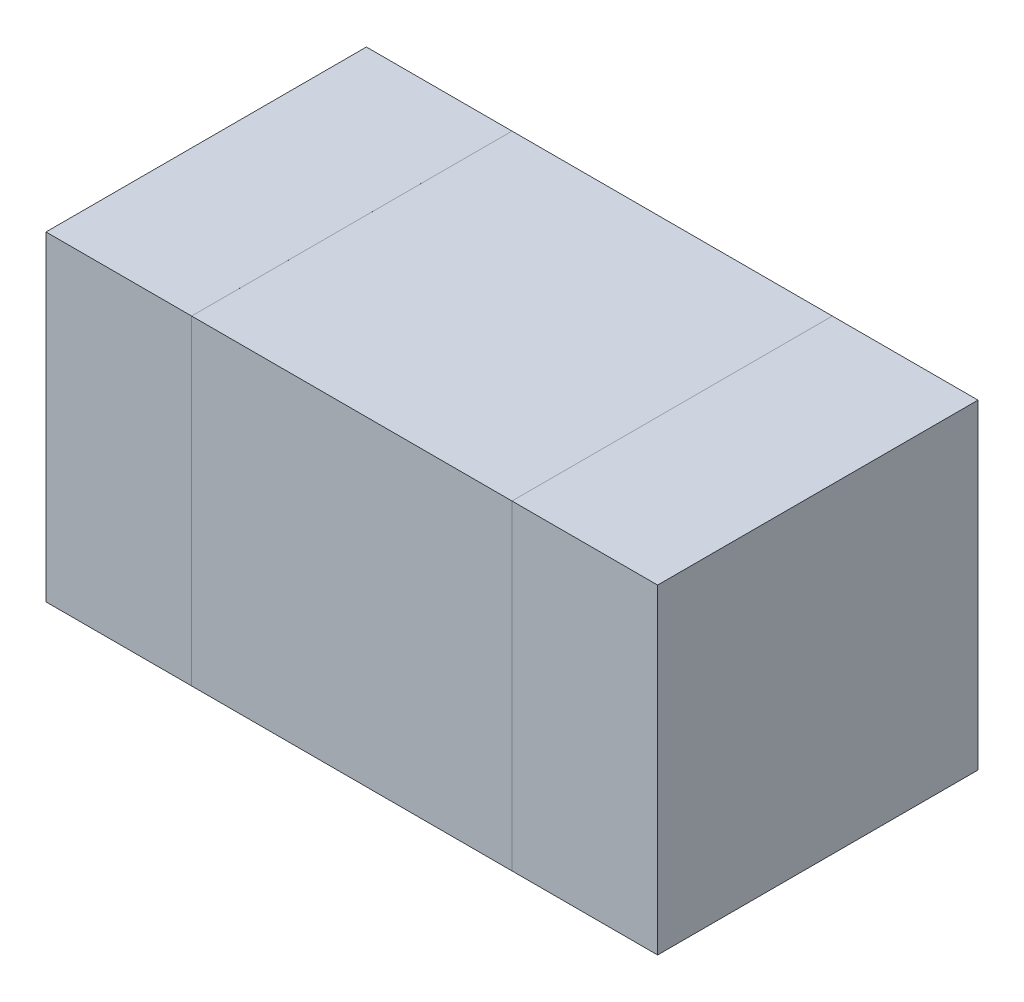
ISO-10303-21;
HEADER;
FILE_DESCRIPTION(('STEP AP214'),'2;1');
FILE_NAME('part.step','',(''),(''),'','','');
FILE_SCHEMA(('AUTOMOTIVE_DESIGN { 1 0 10303 214 1 1 1 1 }'));
ENDSEC;
DATA;
#1=APPLICATION_CONTEXT('core data for automotive mechanical design processes');
#2=APPLICATION_PROTOCOL_DEFINITION('international standard','automotive_design',2000,#1);
#3=PRODUCT_CONTEXT('',#1,'mechanical');
#4=PRODUCT('Part','Part','',(#3));
#5=PRODUCT_RELATED_PRODUCT_CATEGORY('part','',(#4));
#6=PRODUCT_DEFINITION_FORMATION('','',#4);
#7=PRODUCT_DEFINITION_CONTEXT('part definition',#1,'design');
#8=PRODUCT_DEFINITION('design','',#6,#7);
#9=PRODUCT_DEFINITION_SHAPE('','',#8);
#10=(LENGTH_UNIT() NAMED_UNIT(*) SI_UNIT(.MILLI.,.METRE.));
#11=(NAMED_UNIT(*) PLANE_ANGLE_UNIT() SI_UNIT($,.RADIAN.));
#12=(NAMED_UNIT(*) SI_UNIT($,.STERADIAN.) SOLID_ANGLE_UNIT());
#13=UNCERTAINTY_MEASURE_WITH_UNIT(LENGTH_MEASURE(1.E-05),#10,'distance_accuracy_value','');
#14=(GEOMETRIC_REPRESENTATION_CONTEXT(3) GLOBAL_UNCERTAINTY_ASSIGNED_CONTEXT((#13)) GLOBAL_UNIT_ASSIGNED_CONTEXT((#10,
#11,#12)) REPRESENTATION_CONTEXT('',''));
#15=CARTESIAN_POINT('',(0.,0.,0.));
#16=DIRECTION('',(0.,0.,1.));
#17=DIRECTION('',(1.,0.,0.));
#18=AXIS2_PLACEMENT_3D('',#15,#16,#17);
#19=CARTESIAN_POINT('',(1.489995475586,8.035000471953,0.32999934));
#20=DIRECTION('',(0.,0.,-1.));
#21=DIRECTION('',(0.,-1.,0.));
#22=AXIS2_PLACEMENT_3D('',#19,#20,#21);
#23=PLANE('',#22);
#24=DIRECTION('',(0.,1.,0.));
#25=VECTOR('',#24,1.);
#26=CARTESIAN_POINT('',(1.489995475586,8.035000471953,0.32999934));
#27=LINE('',#26,#25);
#28=CARTESIAN_POINT('',(1.489995475586,8.035000471953,0.32999934));
#29=VERTEX_POINT('',#28);
#30=CARTESIAN_POINT('',(1.489995475586,8.365002351953,0.32999934));
#31=VERTEX_POINT('',#30);
#32=EDGE_CURVE('P0_E79',#29,#31,#27,.T.);
#33=ORIENTED_EDGE('',*,*,#32,.T.);
#34=DIRECTION('',(-1.,0.,0.));
#35=VECTOR('',#34,1.);
#36=CARTESIAN_POINT('',(1.489995475586,8.365002351953,0.32999934));
#37=LINE('',#36,#35);
#38=CARTESIAN_POINT('',(1.339993235586,8.365002351953,0.32999934));
#39=VERTEX_POINT('',#38);
#40=EDGE_CURVE('P0_E77',#31,#39,#37,.T.);
#41=ORIENTED_EDGE('',*,*,#40,.T.);
#42=DIRECTION('',(0.,-1.,0.));
#43=VECTOR('',#42,1.);
#44=CARTESIAN_POINT('',(1.339993235586,8.365002351953,0.32999934));
#45=LINE('',#44,#43);
#46=CARTESIAN_POINT('',(1.339993235586,8.035000471953,0.32999934));
#47=VERTEX_POINT('',#46);
#48=EDGE_CURVE('P0_E65',#39,#47,#45,.T.);
#49=ORIENTED_EDGE('',*,*,#48,.T.);
#50=DIRECTION('',(1.,0.,0.));
#51=VECTOR('',#50,1.);
#52=CARTESIAN_POINT('',(1.339993235586,8.035000471953,0.32999934));
#53=LINE('',#52,#51);
#54=EDGE_CURVE('P0_E11',#47,#29,#53,.T.);
#55=ORIENTED_EDGE('',*,*,#54,.T.);
#56=EDGE_LOOP('',(#33,#41,#49,#55));
#57=FACE_BOUND('',#56,.T.);
#58=ADVANCED_FACE('P0_F17',(#57),#23,.F.);
#59=CARTESIAN_POINT('',(1.489995475586,8.035000471953,0.));
#60=DIRECTION('',(0.,0.,-1.));
#61=DIRECTION('',(0.,-1.,0.));
#62=AXIS2_PLACEMENT_3D('',#59,#60,#61);
#63=PLANE('',#62);
#64=DIRECTION('',(1.,0.,0.));
#65=VECTOR('',#64,1.);
#66=CARTESIAN_POINT('',(1.339993235586,8.035000471953,0.));
#67=LINE('',#66,#65);
#68=CARTESIAN_POINT('',(1.339993235586,8.035000471953,0.));
#69=VERTEX_POINT('',#68);
#70=CARTESIAN_POINT('',(1.489995475586,8.035000471953,0.));
#71=VERTEX_POINT('',#70);
#72=EDGE_CURVE('P0_E26',#69,#71,#67,.T.);
#73=ORIENTED_EDGE('',*,*,#72,.F.);
#74=DIRECTION('',(0.,-1.,0.));
#75=VECTOR('',#74,1.);
#76=CARTESIAN_POINT('',(1.339993235586,8.365002351953,0.));
#77=LINE('',#76,#75);
#78=CARTESIAN_POINT('',(1.339993235586,8.365002351953,0.));
#79=VERTEX_POINT('',#78);
#80=EDGE_CURVE('P0_E84',#79,#69,#77,.T.);
#81=ORIENTED_EDGE('',*,*,#80,.F.);
#82=DIRECTION('',(-1.,0.,0.));
#83=VECTOR('',#82,1.);
#84=CARTESIAN_POINT('',(1.489995475586,8.365002351953,0.));
#85=LINE('',#84,#83);
#86=CARTESIAN_POINT('',(1.489995475586,8.365002351953,0.));
#87=VERTEX_POINT('',#86);
#88=EDGE_CURVE('P0_E87',#87,#79,#85,.T.);
#89=ORIENTED_EDGE('',*,*,#88,.F.);
#90=DIRECTION('',(0.,1.,0.));
#91=VECTOR('',#90,1.);
#92=CARTESIAN_POINT('',(1.489995475586,8.035000471953,0.));
#93=LINE('',#92,#91);
#94=EDGE_CURVE('P0_E105',#71,#87,#93,.T.);
#95=ORIENTED_EDGE('',*,*,#94,.F.);
#96=EDGE_LOOP('',(#73,#81,#89,#95));
#97=FACE_BOUND('',#96,.T.);
#98=ADVANCED_FACE('P0_F108',(#97),#63,.T.);
#99=CARTESIAN_POINT('',(1.339993235586,8.035000471953,0.));
#100=DIRECTION('',(0.,1.,0.));
#101=DIRECTION('',(1.,0.,0.));
#102=AXIS2_PLACEMENT_3D('',#99,#100,#101);
#103=PLANE('',#102);
#104=ORIENTED_EDGE('',*,*,#72,.T.);
#105=DIRECTION('',(0.,0.,1.));
#106=VECTOR('',#105,1.);
#107=CARTESIAN_POINT('',(1.489995475586,8.035000471953,0.));
#108=LINE('',#107,#106);
#109=EDGE_CURVE('P0_E93',#71,#29,#108,.T.);
#110=ORIENTED_EDGE('',*,*,#109,.T.);
#111=ORIENTED_EDGE('',*,*,#54,.F.);
#112=DIRECTION('',(0.,0.,1.));
#113=VECTOR('',#112,1.);
#114=CARTESIAN_POINT('',(1.339993235586,8.035000471953,0.));
#115=LINE('',#114,#113);
#116=EDGE_CURVE('P0_E72',#69,#47,#115,.T.);
#117=ORIENTED_EDGE('',*,*,#116,.F.);
#118=EDGE_LOOP('',(#104,#110,#111,#117));
#119=FACE_BOUND('',#118,.T.);
#120=ADVANCED_FACE('P0_F99',(#119),#103,.F.);
#121=CARTESIAN_POINT('',(1.339993235586,8.365002351953,0.));
#122=DIRECTION('',(1.,0.,0.));
#123=DIRECTION('',(0.,1.,0.));
#124=AXIS2_PLACEMENT_3D('',#121,#122,#123);
#125=PLANE('',#124);
#126=ORIENTED_EDGE('',*,*,#80,.T.);
#127=ORIENTED_EDGE('',*,*,#116,.T.);
#128=ORIENTED_EDGE('',*,*,#48,.F.);
#129=DIRECTION('',(0.,0.,1.));
#130=VECTOR('',#129,1.);
#131=CARTESIAN_POINT('',(1.339993235586,8.365002351953,0.));
#132=LINE('',#131,#130);
#133=EDGE_CURVE('P0_E70',#79,#39,#132,.T.);
#134=ORIENTED_EDGE('',*,*,#133,.F.);
#135=EDGE_LOOP('',(#126,#127,#128,#134));
#136=FACE_BOUND('',#135,.T.);
#137=ADVANCED_FACE('P0_F68',(#136),#125,.F.);
#138=CARTESIAN_POINT('',(1.489995475586,8.365002351953,0.));
#139=DIRECTION('',(0.,-1.,0.));
#140=DIRECTION('',(0.,0.,-1.));
#141=AXIS2_PLACEMENT_3D('',#138,#139,#140);
#142=PLANE('',#141);
#143=ORIENTED_EDGE('',*,*,#88,.T.);
#144=ORIENTED_EDGE('',*,*,#133,.T.);
#145=ORIENTED_EDGE('',*,*,#40,.F.);
#146=DIRECTION('',(0.,0.,1.));
#147=VECTOR('',#146,1.);
#148=CARTESIAN_POINT('',(1.489995475586,8.365002351953,0.));
#149=LINE('',#148,#147);
#150=EDGE_CURVE('P0_E110',#87,#31,#149,.T.);
#151=ORIENTED_EDGE('',*,*,#150,.F.);
#152=EDGE_LOOP('',(#143,#144,#145,#151));
#153=FACE_BOUND('',#152,.T.);
#154=ADVANCED_FACE('P0_F86',(#153),#142,.F.);
#155=CARTESIAN_POINT('',(1.489995475586,8.035000471953,0.));
#156=DIRECTION('',(-1.,0.,0.));
#157=DIRECTION('',(0.,0.,1.));
#158=AXIS2_PLACEMENT_3D('',#155,#156,#157);
#159=PLANE('',#158);
#160=ORIENTED_EDGE('',*,*,#94,.T.);
#161=ORIENTED_EDGE('',*,*,#150,.T.);
#162=ORIENTED_EDGE('',*,*,#32,.F.);
#163=ORIENTED_EDGE('',*,*,#109,.F.);
#164=EDGE_LOOP('',(#160,#161,#162,#163));
#165=FACE_BOUND('',#164,.T.);
#166=ADVANCED_FACE('P0_F104',(#165),#159,.F.);
#167=CLOSED_SHELL('',(#58,#98,#120,#137,#154,#166));
#168=MANIFOLD_SOLID_BREP('P0_B1',#167);
#169=CARTESIAN_POINT('',(1.009999748047,8.035000471953,0.32999934));
#170=DIRECTION('',(0.,0.,-1.));
#171=DIRECTION('',(0.,-1.,0.));
#172=AXIS2_PLACEMENT_3D('',#169,#170,#171);
#173=PLANE('',#172);
#174=DIRECTION('',(0.,1.,0.));
#175=VECTOR('',#174,1.);
#176=CARTESIAN_POINT('',(1.009999748047,8.035000471953,0.32999934));
#177=LINE('',#176,#175);
#178=CARTESIAN_POINT('',(1.009999748047,8.035000471953,0.32999934));
#179=VERTEX_POINT('',#178);
#180=CARTESIAN_POINT('',(1.009999748047,8.365002351953,0.32999934));
#181=VERTEX_POINT('',#180);
#182=EDGE_CURVE('P1_E79',#179,#181,#177,.T.);
#183=ORIENTED_EDGE('',*,*,#182,.T.);
#184=DIRECTION('',(-1.,0.,0.));
#185=VECTOR('',#184,1.);
#186=CARTESIAN_POINT('',(1.009999748047,8.365002351953,0.32999934));
#187=LINE('',#186,#185);
#188=CARTESIAN_POINT('',(0.859997508047,8.365002351953,0.32999934));
#189=VERTEX_POINT('',#188);
#190=EDGE_CURVE('P1_E103',#181,#189,#187,.T.);
#191=ORIENTED_EDGE('',*,*,#190,.T.);
#192=DIRECTION('',(0.,-1.,0.));
#193=VECTOR('',#192,1.);
#194=CARTESIAN_POINT('',(0.859997508047,8.365002351953,0.32999934));
#195=LINE('',#194,#193);
#196=CARTESIAN_POINT('',(0.859997508047,8.035000471953,0.32999934));
#197=VERTEX_POINT('',#196);
#198=EDGE_CURVE('P1_E72',#189,#197,#195,.T.);
#199=ORIENTED_EDGE('',*,*,#198,.T.);
#200=DIRECTION('',(1.,0.,0.));
#201=VECTOR('',#200,1.);
#202=CARTESIAN_POINT('',(0.859997508047,8.035000471953,0.32999934));
#203=LINE('',#202,#201);
#204=EDGE_CURVE('P1_E11',#197,#179,#203,.T.);
#205=ORIENTED_EDGE('',*,*,#204,.T.);
#206=EDGE_LOOP('',(#183,#191,#199,#205));
#207=FACE_BOUND('',#206,.T.);
#208=ADVANCED_FACE('P1_F17',(#207),#173,.F.);
#209=CARTESIAN_POINT('',(1.009999748047,8.035000471953,0.));
#210=DIRECTION('',(0.,0.,-1.));
#211=DIRECTION('',(0.,-1.,0.));
#212=AXIS2_PLACEMENT_3D('',#209,#210,#211);
#213=PLANE('',#212);
#214=DIRECTION('',(1.,0.,0.));
#215=VECTOR('',#214,1.);
#216=CARTESIAN_POINT('',(0.859997508047,8.035000471953,0.));
#217=LINE('',#216,#215);
#218=CARTESIAN_POINT('',(0.859997508047,8.035000471953,0.));
#219=VERTEX_POINT('',#218);
#220=CARTESIAN_POINT('',(1.009999748047,8.035000471953,0.));
#221=VERTEX_POINT('',#220);
#222=EDGE_CURVE('P1_E20',#219,#221,#217,.T.);
#223=ORIENTED_EDGE('',*,*,#222,.F.);
#224=DIRECTION('',(0.,-1.,0.));
#225=VECTOR('',#224,1.);
#226=CARTESIAN_POINT('',(0.859997508047,8.365002351953,0.));
#227=LINE('',#226,#225);
#228=CARTESIAN_POINT('',(0.859997508047,8.365002351953,0.));
#229=VERTEX_POINT('',#228);
#230=EDGE_CURVE('P1_E107',#229,#219,#227,.T.);
#231=ORIENTED_EDGE('',*,*,#230,.F.);
#232=DIRECTION('',(-1.,0.,0.));
#233=VECTOR('',#232,1.);
#234=CARTESIAN_POINT('',(1.009999748047,8.365002351953,0.));
#235=LINE('',#234,#233);
#236=CARTESIAN_POINT('',(1.009999748047,8.365002351953,0.));
#237=VERTEX_POINT('',#236);
#238=EDGE_CURVE('P1_E81',#237,#229,#235,.T.);
#239=ORIENTED_EDGE('',*,*,#238,.F.);
#240=DIRECTION('',(0.,1.,0.));
#241=VECTOR('',#240,1.);
#242=CARTESIAN_POINT('',(1.009999748047,8.035000471953,0.));
#243=LINE('',#242,#241);
#244=EDGE_CURVE('P1_E77',#221,#237,#243,.T.);
#245=ORIENTED_EDGE('',*,*,#244,.F.);
#246=EDGE_LOOP('',(#223,#231,#239,#245));
#247=FACE_BOUND('',#246,.T.);
#248=ADVANCED_FACE('P1_F83',(#247),#213,.T.);
#249=CARTESIAN_POINT('',(0.859997508047,8.035000471953,0.));
#250=DIRECTION('',(0.,1.,0.));
#251=DIRECTION('',(1.,0.,0.));
#252=AXIS2_PLACEMENT_3D('',#249,#250,#251);
#253=PLANE('',#252);
#254=ORIENTED_EDGE('',*,*,#222,.T.);
#255=DIRECTION('',(0.,0.,1.));
#256=VECTOR('',#255,1.);
#257=CARTESIAN_POINT('',(1.009999748047,8.035000471953,0.));
#258=LINE('',#257,#256);
#259=EDGE_CURVE('P1_E64',#221,#179,#258,.T.);
#260=ORIENTED_EDGE('',*,*,#259,.T.);
#261=ORIENTED_EDGE('',*,*,#204,.F.);
#262=DIRECTION('',(0.,0.,1.));
#263=VECTOR('',#262,1.);
#264=CARTESIAN_POINT('',(0.859997508047,8.035000471953,0.));
#265=LINE('',#264,#263);
#266=EDGE_CURVE('P1_E67',#219,#197,#265,.T.);
#267=ORIENTED_EDGE('',*,*,#266,.F.);
#268=EDGE_LOOP('',(#254,#260,#261,#267));
#269=FACE_BOUND('',#268,.T.);
#270=ADVANCED_FACE('P1_F63',(#269),#253,.F.);
#271=CARTESIAN_POINT('',(0.859997508047,8.365002351953,0.));
#272=DIRECTION('',(1.,0.,0.));
#273=DIRECTION('',(0.,1.,0.));
#274=AXIS2_PLACEMENT_3D('',#271,#272,#273);
#275=PLANE('',#274);
#276=ORIENTED_EDGE('',*,*,#230,.T.);
#277=ORIENTED_EDGE('',*,*,#266,.T.);
#278=ORIENTED_EDGE('',*,*,#198,.F.);
#279=DIRECTION('',(0.,0.,1.));
#280=VECTOR('',#279,1.);
#281=CARTESIAN_POINT('',(0.859997508047,8.365002351953,0.));
#282=LINE('',#281,#280);
#283=EDGE_CURVE('P1_E99',#229,#189,#282,.T.);
#284=ORIENTED_EDGE('',*,*,#283,.F.);
#285=EDGE_LOOP('',(#276,#277,#278,#284));
#286=FACE_BOUND('',#285,.T.);
#287=ADVANCED_FACE('P1_F113',(#286),#275,.F.);
#288=CARTESIAN_POINT('',(1.009999748047,8.365002351953,0.));
#289=DIRECTION('',(0.,-1.,0.));
#290=DIRECTION('',(0.,0.,-1.));
#291=AXIS2_PLACEMENT_3D('',#288,#289,#290);
#292=PLANE('',#291);
#293=ORIENTED_EDGE('',*,*,#238,.T.);
#294=ORIENTED_EDGE('',*,*,#283,.T.);
#295=ORIENTED_EDGE('',*,*,#190,.F.);
#296=DIRECTION('',(0.,0.,1.));
#297=VECTOR('',#296,1.);
#298=CARTESIAN_POINT('',(1.009999748047,8.365002351953,0.));
#299=LINE('',#298,#297);
#300=EDGE_CURVE('P1_E87',#237,#181,#299,.T.);
#301=ORIENTED_EDGE('',*,*,#300,.F.);
#302=EDGE_LOOP('',(#293,#294,#295,#301));
#303=FACE_BOUND('',#302,.T.);
#304=ADVANCED_FACE('P1_F116',(#303),#292,.F.);
#305=CARTESIAN_POINT('',(1.009999748047,8.035000471953,0.));
#306=DIRECTION('',(-1.,0.,0.));
#307=DIRECTION('',(0.,0.,1.));
#308=AXIS2_PLACEMENT_3D('',#305,#306,#307);
#309=PLANE('',#308);
#310=ORIENTED_EDGE('',*,*,#244,.T.);
#311=ORIENTED_EDGE('',*,*,#300,.T.);
#312=ORIENTED_EDGE('',*,*,#182,.F.);
#313=ORIENTED_EDGE('',*,*,#259,.F.);
#314=EDGE_LOOP('',(#310,#311,#312,#313));
#315=FACE_BOUND('',#314,.T.);
#316=ADVANCED_FACE('P1_F75',(#315),#309,.F.);
#317=CLOSED_SHELL('',(#208,#248,#270,#287,#304,#316));
#318=MANIFOLD_SOLID_BREP('P1_B1',#317);
#319=CARTESIAN_POINT('',(1.010005721211,8.365004891953,0.32999934));
#320=DIRECTION('',(0.,0.,-1.));
#321=DIRECTION('',(0.,-1.,0.));
#322=AXIS2_PLACEMENT_3D('',#319,#320,#321);
#323=PLANE('',#322);
#324=DIRECTION('',(-7.69692592462592E-06,-0.999999999970379,0.));
#325=VECTOR('',#324,1.);
#326=CARTESIAN_POINT('',(1.010005721211,8.365004891953,0.32999934));
#327=LINE('',#326,#325);
#328=CARTESIAN_POINT('',(1.010005721211,8.365004891953,0.32999934));
#329=VERTEX_POINT('',#328);
#330=CARTESIAN_POINT('',(1.010003181211,8.035003011953,0.32999934));
#331=VERTEX_POINT('',#330);
#332=EDGE_CURVE('P2_E69',#329,#331,#327,.T.);
#333=ORIENTED_EDGE('',*,*,#332,.T.);
#334=DIRECTION('',(0.999999999970378,-7.69698503855891E-06,0.));
#335=VECTOR('',#334,1.);
#336=CARTESIAN_POINT('',(1.010003181211,8.035003011953,0.32999934));
#337=LINE('',#336,#335);
#338=CARTESIAN_POINT('',(1.340002521211,8.035000471953,0.32999934));
#339=VERTEX_POINT('',#338);
#340=EDGE_CURVE('P2_E67',#331,#339,#337,.T.);
#341=ORIENTED_EDGE('',*,*,#340,.T.);
#342=DIRECTION('',(7.69698508162391E-06,0.999999999970378,0.));
#343=VECTOR('',#342,1.);
#344=CARTESIAN_POINT('',(1.340002521211,8.035000471953,0.32999934));
#345=LINE('',#344,#343);
#346=CARTESIAN_POINT('',(1.340005061211,8.364999811953,0.32999934));
#347=VERTEX_POINT('',#346);
#348=EDGE_CURVE('P2_E20',#339,#347,#345,.T.);
#349=ORIENTED_EDGE('',*,*,#348,.T.);
#350=DIRECTION('',(-0.999999999881513,1.53939702048925E-05,0.));
#351=VECTOR('',#350,1.);
#352=CARTESIAN_POINT('',(1.340005061211,8.364999811953,0.32999934));
#353=LINE('',#352,#351);
#354=EDGE_CURVE('P2_E11',#347,#329,#353,.T.);
#355=ORIENTED_EDGE('',*,*,#354,.T.);
#356=EDGE_LOOP('',(#333,#341,#349,#355));
#357=FACE_BOUND('',#356,.T.);
#358=ADVANCED_FACE('P2_F17',(#357),#323,.F.);
#359=CARTESIAN_POINT('',(1.010005721211,8.365004891953,0.));
#360=DIRECTION('',(0.,0.,-1.));
#361=DIRECTION('',(0.,-1.,0.));
#362=AXIS2_PLACEMENT_3D('',#359,#360,#361);
#363=PLANE('',#362);
#364=DIRECTION('',(-0.999999999881513,1.53939702048925E-05,0.));
#365=VECTOR('',#364,1.);
#366=CARTESIAN_POINT('',(1.340005061211,8.364999811953,0.));
#367=LINE('',#366,#365);
#368=CARTESIAN_POINT('',(1.340005061211,8.364999811953,0.));
#369=VERTEX_POINT('',#368);
#370=CARTESIAN_POINT('',(1.010005721211,8.365004891953,0.));
#371=VERTEX_POINT('',#370);
#372=EDGE_CURVE('P2_E27',#369,#371,#367,.T.);
#373=ORIENTED_EDGE('',*,*,#372,.F.);
#374=DIRECTION('',(7.69698508162391E-06,0.999999999970378,0.));
#375=VECTOR('',#374,1.);
#376=CARTESIAN_POINT('',(1.340002521211,8.035000471953,0.));
#377=LINE('',#376,#375);
#378=CARTESIAN_POINT('',(1.340002521211,8.035000471953,0.));
#379=VERTEX_POINT('',#378);
#380=EDGE_CURVE('P2_E74',#379,#369,#377,.T.);
#381=ORIENTED_EDGE('',*,*,#380,.F.);
#382=DIRECTION('',(0.999999999970378,-7.69698503855891E-06,0.));
#383=VECTOR('',#382,1.);
#384=CARTESIAN_POINT('',(1.010003181211,8.035003011953,0.));
#385=LINE('',#384,#383);
#386=CARTESIAN_POINT('',(1.010003181211,8.035003011953,0.));
#387=VERTEX_POINT('',#386);
#388=EDGE_CURVE('P2_E78',#387,#379,#385,.T.);
#389=ORIENTED_EDGE('',*,*,#388,.F.);
#390=DIRECTION('',(-7.69692592462592E-06,-0.999999999970379,0.));
#391=VECTOR('',#390,1.);
#392=CARTESIAN_POINT('',(1.010005721211,8.365004891953,0.));
#393=LINE('',#392,#391);
#394=EDGE_CURVE('P2_E150',#371,#387,#393,.T.);
#395=ORIENTED_EDGE('',*,*,#394,.F.);
#396=EDGE_LOOP('',(#373,#381,#389,#395));
#397=FACE_BOUND('',#396,.T.);
#398=ADVANCED_FACE('P2_F108',(#397),#363,.T.);
#399=CARTESIAN_POINT('',(1.340005061211,8.364999811953,0.));
#400=DIRECTION('',(-1.53939702048925E-05,-0.999999999881513,0.));
#401=DIRECTION('',(-0.999999999881513,1.53939702048925E-05,0.));
#402=AXIS2_PLACEMENT_3D('',#399,#400,#401);
#403=PLANE('',#402);
#404=ORIENTED_EDGE('',*,*,#372,.T.);
#405=DIRECTION('',(0.,0.,1.));
#406=VECTOR('',#405,1.);
#407=CARTESIAN_POINT('',(1.010005721211,8.365004891953,0.));
#408=LINE('',#407,#406);
#409=EDGE_CURVE('P2_E84',#371,#329,#408,.T.);
#410=ORIENTED_EDGE('',*,*,#409,.T.);
#411=ORIENTED_EDGE('',*,*,#354,.F.);
#412=DIRECTION('',(0.,0.,1.));
#413=VECTOR('',#412,1.);
#414=CARTESIAN_POINT('',(1.340005061211,8.364999811953,0.));
#415=LINE('',#414,#413);
#416=EDGE_CURVE('P2_E62',#369,#347,#415,.T.);
#417=ORIENTED_EDGE('',*,*,#416,.F.);
#418=EDGE_LOOP('',(#404,#410,#411,#417));
#419=FACE_BOUND('',#418,.T.);
#420=ADVANCED_FACE('P2_F112',(#419),#403,.F.);
#421=CARTESIAN_POINT('',(1.340002521211,8.035000471953,0.));
#422=DIRECTION('',(-0.999999999970378,7.69698508162391E-06,0.));
#423=DIRECTION('',(0.,0.,1.));
#424=AXIS2_PLACEMENT_3D('',#421,#422,#423);
#425=PLANE('',#424);
#426=ORIENTED_EDGE('',*,*,#380,.T.);
#427=ORIENTED_EDGE('',*,*,#416,.T.);
#428=ORIENTED_EDGE('',*,*,#348,.F.);
#429=DIRECTION('',(0.,0.,1.));
#430=VECTOR('',#429,1.);
#431=CARTESIAN_POINT('',(1.340002521211,8.035000471953,0.));
#432=LINE('',#431,#430);
#433=EDGE_CURVE('P2_E60',#379,#339,#432,.T.);
#434=ORIENTED_EDGE('',*,*,#433,.F.);
#435=EDGE_LOOP('',(#426,#427,#428,#434));
#436=FACE_BOUND('',#435,.T.);
#437=ADVANCED_FACE('P2_F58',(#436),#425,.F.);
#438=CARTESIAN_POINT('',(1.010003181211,8.035003011953,0.));
#439=DIRECTION('',(7.69698503855891E-06,0.999999999970378,0.));
#440=DIRECTION('',(0.,0.,-1.));
#441=AXIS2_PLACEMENT_3D('',#438,#439,#440);
#442=PLANE('',#441);
#443=ORIENTED_EDGE('',*,*,#388,.T.);
#444=ORIENTED_EDGE('',*,*,#433,.T.);
#445=ORIENTED_EDGE('',*,*,#340,.F.);
#446=DIRECTION('',(0.,0.,1.));
#447=VECTOR('',#446,1.);
#448=CARTESIAN_POINT('',(1.010003181211,8.035003011953,0.));
#449=LINE('',#448,#447);
#450=EDGE_CURVE('P2_E151',#387,#331,#449,.T.);
#451=ORIENTED_EDGE('',*,*,#450,.F.);
#452=EDGE_LOOP('',(#443,#444,#445,#451));
#453=FACE_BOUND('',#452,.T.);
#454=ADVANCED_FACE('P2_F76',(#453),#442,.F.);
#455=CARTESIAN_POINT('',(1.010005721211,8.365004891953,0.));
#456=DIRECTION('',(0.999999999970379,-7.69692592462592E-06,0.));
#457=DIRECTION('',(0.,0.,-1.));
#458=AXIS2_PLACEMENT_3D('',#455,#456,#457);
#459=PLANE('',#458);
#460=ORIENTED_EDGE('',*,*,#394,.T.);
#461=ORIENTED_EDGE('',*,*,#450,.T.);
#462=ORIENTED_EDGE('',*,*,#332,.F.);
#463=ORIENTED_EDGE('',*,*,#409,.F.);
#464=EDGE_LOOP('',(#460,#461,#462,#463));
#465=FACE_BOUND('',#464,.T.);
#466=ADVANCED_FACE('P2_F98',(#465),#459,.F.);
#467=CLOSED_SHELL('',(#358,#398,#420,#437,#454,#466));
#468=MANIFOLD_SOLID_BREP('P2_B1',#467);
#469=ADVANCED_BREP_SHAPE_REPRESENTATION('',(#18,#168,#318,#468),#14);
#470=SHAPE_DEFINITION_REPRESENTATION(#9,#469);
ENDSEC;
END-ISO-10303-21;
